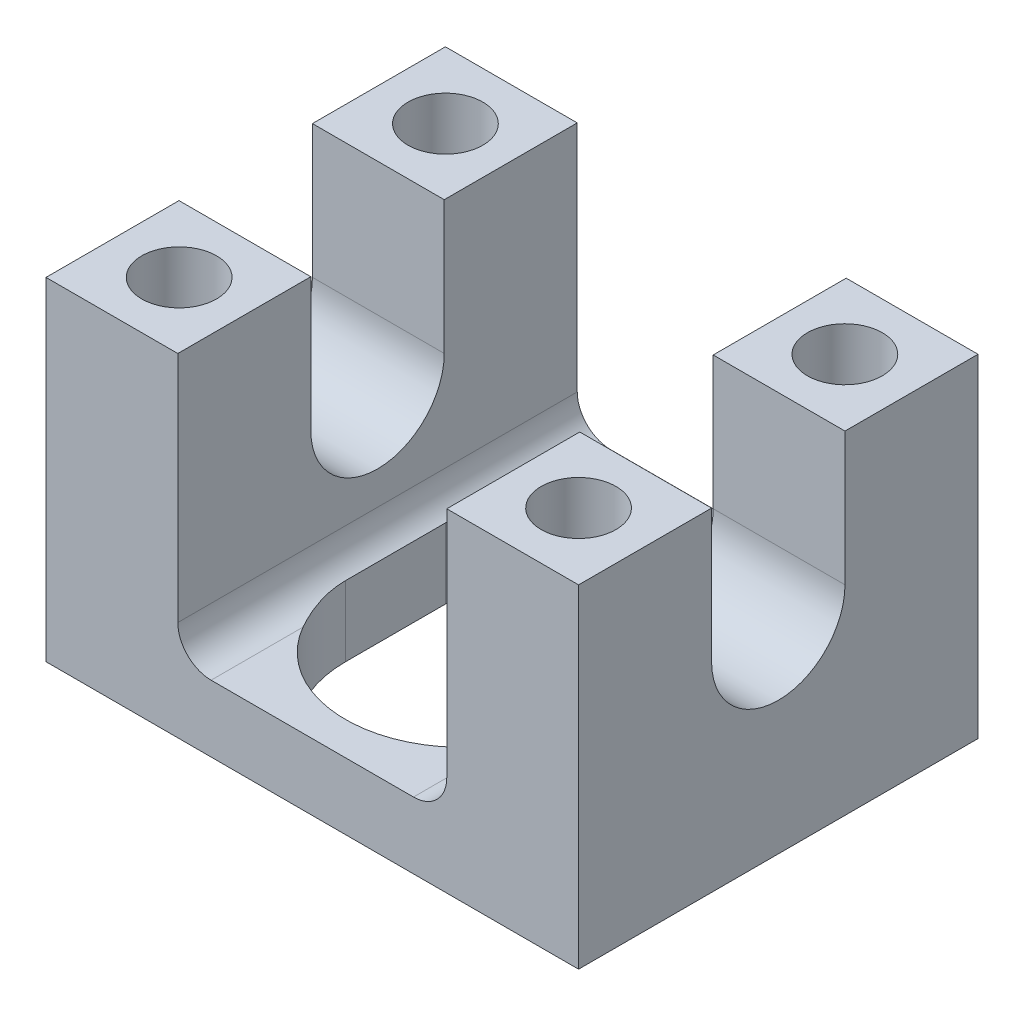
ISO-10303-21;
HEADER;
FILE_DESCRIPTION(('STEP AP214'),'2;1');
FILE_NAME('part.step','',(''),(''),'','','');
FILE_SCHEMA(('AUTOMOTIVE_DESIGN { 1 0 10303 214 1 1 1 1 }'));
ENDSEC;
DATA;
#1=APPLICATION_CONTEXT('core data for automotive mechanical design processes');
#2=APPLICATION_PROTOCOL_DEFINITION('international standard','automotive_design',2000,#1);
#3=PRODUCT_CONTEXT('',#1,'mechanical');
#4=PRODUCT('Part','Part','',(#3));
#5=PRODUCT_RELATED_PRODUCT_CATEGORY('part','',(#4));
#6=PRODUCT_DEFINITION_FORMATION('','',#4);
#7=PRODUCT_DEFINITION_CONTEXT('part definition',#1,'design');
#8=PRODUCT_DEFINITION('design','',#6,#7);
#9=PRODUCT_DEFINITION_SHAPE('','',#8);
#10=(LENGTH_UNIT() NAMED_UNIT(*) SI_UNIT(.MILLI.,.METRE.));
#11=(NAMED_UNIT(*) PLANE_ANGLE_UNIT() SI_UNIT($,.RADIAN.));
#12=(NAMED_UNIT(*) SI_UNIT($,.STERADIAN.) SOLID_ANGLE_UNIT());
#13=UNCERTAINTY_MEASURE_WITH_UNIT(LENGTH_MEASURE(1.E-05),#10,'distance_accuracy_value','');
#14=(GEOMETRIC_REPRESENTATION_CONTEXT(3) GLOBAL_UNCERTAINTY_ASSIGNED_CONTEXT((#13)) GLOBAL_UNIT_ASSIGNED_CONTEXT((#10,
#11,#12)) REPRESENTATION_CONTEXT('',''));
#15=CARTESIAN_POINT('',(0.,0.,0.));
#16=DIRECTION('',(0.,0.,1.));
#17=DIRECTION('',(1.,0.,0.));
#18=AXIS2_PLACEMENT_3D('',#15,#16,#17);
#19=CARTESIAN_POINT('',(12.827,-9.525,19.05));
#20=DIRECTION('',(0.,-1.,0.));
#21=DIRECTION('',(0.,0.,-1.));
#22=AXIS2_PLACEMENT_3D('',#19,#20,#21);
#23=PLANE('',#22);
#24=DIRECTION('',(0.,0.,-1.));
#25=VECTOR('',#24,1.);
#26=CARTESIAN_POINT('',(-9.652,-9.525,19.05));
#27=LINE('',#26,#25);
#28=CARTESIAN_POINT('',(-9.652,-9.525,-19.05));
#29=VERTEX_POINT('',#28);
#30=CARTESIAN_POINT('',(-9.652,-9.525,-10.2821548981265));
#31=VERTEX_POINT('',#30);
#32=EDGE_CURVE('E400',#29,#31,#27,.F.);
#33=ORIENTED_EDGE('',*,*,#32,.T.);
#34=CARTESIAN_POINT('',(0.,-9.525,-4.7752));
#35=DIRECTION('',(0.,-1.,0.));
#36=DIRECTION('',(0.,0.,-1.));
#37=AXIS2_PLACEMENT_3D('',#34,#35,#36);
#38=CIRCLE('',#37,11.1125);
#39=CARTESIAN_POINT('',(9.652,-9.525,-10.2821548981266));
#40=VERTEX_POINT('',#39);
#41=EDGE_CURVE('E249',#31,#40,#38,.T.);
#42=ORIENTED_EDGE('',*,*,#41,.T.);
#43=DIRECTION('',(0.,0.,-1.));
#44=VECTOR('',#43,1.);
#45=CARTESIAN_POINT('',(9.652,-9.525,-19.05));
#46=LINE('',#45,#44);
#47=CARTESIAN_POINT('',(9.652,-9.525,-19.05));
#48=VERTEX_POINT('',#47);
#49=EDGE_CURVE('E403',#40,#48,#46,.T.);
#50=ORIENTED_EDGE('',*,*,#49,.T.);
#51=DIRECTION('',(-1.,0.,0.));
#52=VECTOR('',#51,1.);
#53=CARTESIAN_POINT('',(12.827,-9.525,-19.05));
#54=LINE('',#53,#52);
#55=EDGE_CURVE('E367',#48,#29,#54,.T.);
#56=ORIENTED_EDGE('',*,*,#55,.T.);
#57=EDGE_LOOP('',(#33,#42,#50,#56));
#58=FACE_BOUND('',#57,.T.);
#59=ADVANCED_FACE('F44',(#58),#23,.F.);
#60=CARTESIAN_POINT('',(25.4,15.875,19.05));
#61=DIRECTION('',(0.,-1.,0.));
#62=DIRECTION('',(1.,0.,0.));
#63=AXIS2_PLACEMENT_3D('',#60,#61,#62);
#64=PLANE('',#63);
#65=CARTESIAN_POINT('',(19.05,15.875,12.7));
#66=DIRECTION('',(0.,1.,0.));
#67=DIRECTION('',(0.,0.,1.));
#68=AXIS2_PLACEMENT_3D('',#65,#66,#67);
#69=CIRCLE('',#68,3.5687);
#70=CARTESIAN_POINT('',(19.05,15.875,16.2687));
#71=VERTEX_POINT('',#70);
#72=EDGE_CURVE('E552',#71,#71,#69,.T.);
#73=ORIENTED_EDGE('',*,*,#72,.F.);
#74=EDGE_LOOP('',(#73));
#75=FACE_BOUND('',#74,.T.);
#76=DIRECTION('',(0.,0.,-1.));
#77=VECTOR('',#76,1.);
#78=CARTESIAN_POINT('',(25.4,15.875,19.05));
#79=LINE('',#78,#77);
#80=CARTESIAN_POINT('',(25.4,15.875,19.05));
#81=VERTEX_POINT('',#80);
#82=CARTESIAN_POINT('',(25.4,15.875,6.3627));
#83=VERTEX_POINT('',#82);
#84=EDGE_CURVE('E396',#81,#83,#79,.T.);
#85=ORIENTED_EDGE('',*,*,#84,.T.);
#86=DIRECTION('',(-1.,0.,0.));
#87=VECTOR('',#86,1.);
#88=CARTESIAN_POINT('',(25.4,15.875,6.3627));
#89=LINE('',#88,#87);
#90=CARTESIAN_POINT('',(12.827,15.875,6.3627));
#91=VERTEX_POINT('',#90);
#92=EDGE_CURVE('E305',#83,#91,#89,.T.);
#93=ORIENTED_EDGE('',*,*,#92,.T.);
#94=DIRECTION('',(0.,0.,-1.));
#95=VECTOR('',#94,1.);
#96=CARTESIAN_POINT('',(12.827,15.875,19.05));
#97=LINE('',#96,#95);
#98=CARTESIAN_POINT('',(12.827,15.875,19.05));
#99=VERTEX_POINT('',#98);
#100=EDGE_CURVE('E392',#99,#91,#97,.T.);
#101=ORIENTED_EDGE('',*,*,#100,.F.);
#102=DIRECTION('',(-1.,0.,0.));
#103=VECTOR('',#102,1.);
#104=CARTESIAN_POINT('',(25.4,15.875,19.05));
#105=LINE('',#104,#103);
#106=EDGE_CURVE('E341',#81,#99,#105,.T.);
#107=ORIENTED_EDGE('',*,*,#106,.F.);
#108=EDGE_LOOP('',(#85,#93,#101,#107));
#109=FACE_BOUND('',#108,.T.);
#110=ADVANCED_FACE('F477',(#75,#109),#64,.F.);
#111=CARTESIAN_POINT('',(-12.827,15.875,19.05));
#112=DIRECTION('',(0.,-1.,0.));
#113=DIRECTION('',(0.,0.,-1.));
#114=AXIS2_PLACEMENT_3D('',#111,#112,#113);
#115=PLANE('',#114);
#116=CARTESIAN_POINT('',(-19.05,15.875,12.7));
#117=DIRECTION('',(0.,1.,0.));
#118=DIRECTION('',(0.,0.,1.));
#119=AXIS2_PLACEMENT_3D('',#116,#117,#118);
#120=CIRCLE('',#119,3.5687);
#121=CARTESIAN_POINT('',(-19.05,15.875,16.2687));
#122=VERTEX_POINT('',#121);
#123=EDGE_CURVE('E546',#122,#122,#120,.T.);
#124=ORIENTED_EDGE('',*,*,#123,.F.);
#125=EDGE_LOOP('',(#124));
#126=FACE_BOUND('',#125,.T.);
#127=DIRECTION('',(0.,0.,-1.));
#128=VECTOR('',#127,1.);
#129=CARTESIAN_POINT('',(-12.827,15.875,19.05));
#130=LINE('',#129,#128);
#131=CARTESIAN_POINT('',(-12.827,15.875,19.05));
#132=VERTEX_POINT('',#131);
#133=CARTESIAN_POINT('',(-12.827,15.875,6.3627));
#134=VERTEX_POINT('',#133);
#135=EDGE_CURVE('E388',#132,#134,#130,.T.);
#136=ORIENTED_EDGE('',*,*,#135,.T.);
#137=CARTESIAN_POINT('',(-25.4,15.875,6.3627));
#138=VERTEX_POINT('',#137);
#139=EDGE_CURVE('E309',#134,#138,#89,.T.);
#140=ORIENTED_EDGE('',*,*,#139,.T.);
#141=DIRECTION('',(0.,0.,-1.));
#142=VECTOR('',#141,1.);
#143=CARTESIAN_POINT('',(-25.4,15.875,19.05));
#144=LINE('',#143,#142);
#145=CARTESIAN_POINT('',(-25.4,15.875,19.05));
#146=VERTEX_POINT('',#145);
#147=EDGE_CURVE('E384',#146,#138,#144,.T.);
#148=ORIENTED_EDGE('',*,*,#147,.F.);
#149=DIRECTION('',(-1.,0.,0.));
#150=VECTOR('',#149,1.);
#151=CARTESIAN_POINT('',(-12.827,15.875,19.05));
#152=LINE('',#151,#150);
#153=EDGE_CURVE('E352',#132,#146,#152,.T.);
#154=ORIENTED_EDGE('',*,*,#153,.F.);
#155=EDGE_LOOP('',(#136,#140,#148,#154));
#156=FACE_BOUND('',#155,.T.);
#157=ADVANCED_FACE('F460',(#126,#156),#115,.F.);
#158=CARTESIAN_POINT('',(25.4,15.875,19.05));
#159=DIRECTION('',(-1.,0.,0.));
#160=DIRECTION('',(0.,0.,1.));
#161=AXIS2_PLACEMENT_3D('',#158,#159,#160);
#162=PLANE('',#161);
#163=CARTESIAN_POINT('',(25.4,3.17500000000001,0.));
#164=DIRECTION('',(-1.,0.,0.));
#165=DIRECTION('',(0.,-1.,0.));
#166=AXIS2_PLACEMENT_3D('',#163,#164,#165);
#167=CIRCLE('',#166,6.3627);
#168=CARTESIAN_POINT('',(25.4,3.17500000000001,-6.3627));
#169=VERTEX_POINT('',#168);
#170=CARTESIAN_POINT('',(25.4,3.17500000000001,6.3627));
#171=VERTEX_POINT('',#170);
#172=EDGE_CURVE('E291',#169,#171,#167,.T.);
#173=ORIENTED_EDGE('',*,*,#172,.T.);
#174=DIRECTION('',(0.,1.,0.));
#175=VECTOR('',#174,1.);
#176=CARTESIAN_POINT('',(25.4,15.875,6.3627));
#177=LINE('',#176,#175);
#178=EDGE_CURVE('E295',#171,#83,#177,.T.);
#179=ORIENTED_EDGE('',*,*,#178,.T.);
#180=ORIENTED_EDGE('',*,*,#84,.F.);
#181=DIRECTION('',(0.,1.,0.));
#182=VECTOR('',#181,1.);
#183=CARTESIAN_POINT('',(25.4,15.875,19.05));
#184=LINE('',#183,#182);
#185=CARTESIAN_POINT('',(25.4,-15.875,19.05));
#186=VERTEX_POINT('',#185);
#187=EDGE_CURVE('E338',#186,#81,#184,.T.);
#188=ORIENTED_EDGE('',*,*,#187,.F.);
#189=DIRECTION('',(0.,0.,-1.));
#190=VECTOR('',#189,1.);
#191=CARTESIAN_POINT('',(25.4,-15.875,19.05));
#192=LINE('',#191,#190);
#193=CARTESIAN_POINT('',(25.4,-15.875,-19.05));
#194=VERTEX_POINT('',#193);
#195=EDGE_CURVE('E358',#186,#194,#192,.T.);
#196=ORIENTED_EDGE('',*,*,#195,.T.);
#197=DIRECTION('',(0.,1.,0.));
#198=VECTOR('',#197,1.);
#199=CARTESIAN_POINT('',(25.4,15.875,-19.05));
#200=LINE('',#199,#198);
#201=CARTESIAN_POINT('',(25.4,15.875,-19.05));
#202=VERTEX_POINT('',#201);
#203=EDGE_CURVE('E337',#194,#202,#200,.T.);
#204=ORIENTED_EDGE('',*,*,#203,.T.);
#205=CARTESIAN_POINT('',(25.4,15.875,-6.3627));
#206=VERTEX_POINT('',#205);
#207=EDGE_CURVE('E395',#206,#202,#79,.T.);
#208=ORIENTED_EDGE('',*,*,#207,.F.);
#209=DIRECTION('',(0.,-1.,0.));
#210=VECTOR('',#209,1.);
#211=CARTESIAN_POINT('',(25.4,15.875,-6.3627));
#212=LINE('',#211,#210);
#213=EDGE_CURVE('E288',#206,#169,#212,.T.);
#214=ORIENTED_EDGE('',*,*,#213,.T.);
#215=EDGE_LOOP('',(#173,#179,#180,#188,#196,#204,#208,#214));
#216=FACE_BOUND('',#215,.T.);
#217=ADVANCED_FACE('F472',(#216),#162,.F.);
#218=CARTESIAN_POINT('',(19.05,15.875,-12.7));
#219=DIRECTION('',(0.,1.,0.));
#220=DIRECTION('',(0.,0.,1.));
#221=AXIS2_PLACEMENT_3D('',#218,#219,#220);
#222=CIRCLE('',#221,3.5687);
#223=CARTESIAN_POINT('',(19.05,15.875,-9.1313));
#224=VERTEX_POINT('',#223);
#225=EDGE_CURVE('E227',#224,#224,#222,.T.);
#226=ORIENTED_EDGE('',*,*,#225,.F.);
#227=EDGE_LOOP('',(#226));
#228=FACE_BOUND('',#227,.T.);
#229=CARTESIAN_POINT('',(12.827,15.875,-6.3627));
#230=VERTEX_POINT('',#229);
#231=CARTESIAN_POINT('',(12.827,15.875,-19.05));
#232=VERTEX_POINT('',#231);
#233=EDGE_CURVE('E391',#230,#232,#97,.T.);
#234=ORIENTED_EDGE('',*,*,#233,.F.);
#235=DIRECTION('',(-1.,0.,0.));
#236=VECTOR('',#235,1.);
#237=CARTESIAN_POINT('',(25.4,15.875,-6.3627));
#238=LINE('',#237,#236);
#239=EDGE_CURVE('E318',#206,#230,#238,.T.);
#240=ORIENTED_EDGE('',*,*,#239,.F.);
#241=ORIENTED_EDGE('',*,*,#207,.T.);
#242=DIRECTION('',(-1.,0.,0.));
#243=VECTOR('',#242,1.);
#244=CARTESIAN_POINT('',(25.4,15.875,-19.05));
#245=LINE('',#244,#243);
#246=EDGE_CURVE('E361',#202,#232,#245,.T.);
#247=ORIENTED_EDGE('',*,*,#246,.T.);
#248=EDGE_LOOP('',(#234,#240,#241,#247));
#249=FACE_BOUND('',#248,.T.);
#250=ADVANCED_FACE('F493',(#228,#249),#64,.F.);
#251=CARTESIAN_POINT('',(12.827,15.875,19.05));
#252=DIRECTION('',(1.,0.,0.));
#253=DIRECTION('',(0.,0.,-1.));
#254=AXIS2_PLACEMENT_3D('',#251,#252,#253);
#255=PLANE('',#254);
#256=DIRECTION('',(0.,-1.,0.));
#257=VECTOR('',#256,1.);
#258=CARTESIAN_POINT('',(12.827,15.875,-19.05));
#259=LINE('',#258,#257);
#260=CARTESIAN_POINT('',(12.827,-6.35,-19.05));
#261=VERTEX_POINT('',#260);
#262=EDGE_CURVE('E364',#232,#261,#259,.T.);
#263=ORIENTED_EDGE('',*,*,#262,.T.);
#264=DIRECTION('',(0.,0.,-1.));
#265=VECTOR('',#264,1.);
#266=CARTESIAN_POINT('',(12.827,-6.35,19.05));
#267=LINE('',#266,#265);
#268=CARTESIAN_POINT('',(12.827,-6.35,19.05));
#269=VERTEX_POINT('',#268);
#270=EDGE_CURVE('E407',#261,#269,#267,.F.);
#271=ORIENTED_EDGE('',*,*,#270,.T.);
#272=DIRECTION('',(0.,-1.,0.));
#273=VECTOR('',#272,1.);
#274=CARTESIAN_POINT('',(12.827,15.875,19.05));
#275=LINE('',#274,#273);
#276=EDGE_CURVE('E344',#99,#269,#275,.T.);
#277=ORIENTED_EDGE('',*,*,#276,.F.);
#278=ORIENTED_EDGE('',*,*,#100,.T.);
#279=DIRECTION('',(0.,-1.,0.));
#280=VECTOR('',#279,1.);
#281=CARTESIAN_POINT('',(12.827,15.875,6.3627));
#282=LINE('',#281,#280);
#283=CARTESIAN_POINT('',(12.827,3.17500000000001,6.3627));
#284=VERTEX_POINT('',#283);
#285=EDGE_CURVE('E334',#91,#284,#282,.T.);
#286=ORIENTED_EDGE('',*,*,#285,.T.);
#287=CARTESIAN_POINT('',(12.827,3.17500000000001,0.));
#288=DIRECTION('',(1.,0.,0.));
#289=DIRECTION('',(0.,0.,-1.));
#290=AXIS2_PLACEMENT_3D('',#287,#288,#289);
#291=CIRCLE('',#290,6.3627);
#292=CARTESIAN_POINT('',(12.827,3.17500000000001,-6.3627));
#293=VERTEX_POINT('',#292);
#294=EDGE_CURVE('E328',#284,#293,#291,.T.);
#295=ORIENTED_EDGE('',*,*,#294,.T.);
#296=DIRECTION('',(0.,1.,0.));
#297=VECTOR('',#296,1.);
#298=CARTESIAN_POINT('',(12.827,15.875,-6.3627));
#299=LINE('',#298,#297);
#300=EDGE_CURVE('E322',#293,#230,#299,.T.);
#301=ORIENTED_EDGE('',*,*,#300,.T.);
#302=ORIENTED_EDGE('',*,*,#233,.T.);
#303=EDGE_LOOP('',(#263,#271,#277,#278,#286,#295,#301,#302));
#304=FACE_BOUND('',#303,.T.);
#305=ADVANCED_FACE('F479',(#304),#255,.F.);
#306=CARTESIAN_POINT('',(9.652,-9.525,19.05));
#307=VERTEX_POINT('',#306);
#308=CARTESIAN_POINT('',(9.652,-9.525,10.2821548981266));
#309=VERTEX_POINT('',#308);
#310=EDGE_CURVE('E404',#307,#309,#46,.T.);
#311=ORIENTED_EDGE('',*,*,#310,.T.);
#312=CARTESIAN_POINT('',(0.,-9.525,4.7752));
#313=DIRECTION('',(0.,-1.,0.));
#314=DIRECTION('',(0.,0.,-1.));
#315=AXIS2_PLACEMENT_3D('',#312,#313,#314);
#316=CIRCLE('',#315,11.1125);
#317=CARTESIAN_POINT('',(-9.652,-9.525,10.2821548981265));
#318=VERTEX_POINT('',#317);
#319=EDGE_CURVE('E235',#309,#318,#316,.T.);
#320=ORIENTED_EDGE('',*,*,#319,.T.);
#321=CARTESIAN_POINT('',(-9.652,-9.525,19.05));
#322=VERTEX_POINT('',#321);
#323=EDGE_CURVE('E399',#318,#322,#27,.F.);
#324=ORIENTED_EDGE('',*,*,#323,.T.);
#325=DIRECTION('',(-1.,0.,0.));
#326=VECTOR('',#325,1.);
#327=CARTESIAN_POINT('',(12.827,-9.525,19.05));
#328=LINE('',#327,#326);
#329=EDGE_CURVE('E347',#307,#322,#328,.T.);
#330=ORIENTED_EDGE('',*,*,#329,.F.);
#331=EDGE_LOOP('',(#311,#320,#324,#330));
#332=FACE_BOUND('',#331,.T.);
#333=ADVANCED_FACE('F425',(#332),#23,.F.);
#334=CARTESIAN_POINT('',(-12.827,-9.525,19.05));
#335=DIRECTION('',(-1.,0.,0.));
#336=DIRECTION('',(0.,0.,1.));
#337=AXIS2_PLACEMENT_3D('',#334,#335,#336);
#338=PLANE('',#337);
#339=DIRECTION('',(0.,1.,0.));
#340=VECTOR('',#339,1.);
#341=CARTESIAN_POINT('',(-12.827,-9.525,19.05));
#342=LINE('',#341,#340);
#343=CARTESIAN_POINT('',(-12.827,-6.35,19.05));
#344=VERTEX_POINT('',#343);
#345=EDGE_CURVE('E350',#344,#132,#342,.T.);
#346=ORIENTED_EDGE('',*,*,#345,.F.);
#347=DIRECTION('',(0.,0.,-1.));
#348=VECTOR('',#347,1.);
#349=CARTESIAN_POINT('',(-12.827,-6.35,-19.05));
#350=LINE('',#349,#348);
#351=CARTESIAN_POINT('',(-12.827,-6.35,-19.05));
#352=VERTEX_POINT('',#351);
#353=EDGE_CURVE('E409',#344,#352,#350,.T.);
#354=ORIENTED_EDGE('',*,*,#353,.T.);
#355=DIRECTION('',(0.,1.,0.));
#356=VECTOR('',#355,1.);
#357=CARTESIAN_POINT('',(-12.827,-9.525,-19.05));
#358=LINE('',#357,#356);
#359=CARTESIAN_POINT('',(-12.827,15.875,-19.05));
#360=VERTEX_POINT('',#359);
#361=EDGE_CURVE('E370',#352,#360,#358,.T.);
#362=ORIENTED_EDGE('',*,*,#361,.T.);
#363=CARTESIAN_POINT('',(-12.827,15.875,-6.3627));
#364=VERTEX_POINT('',#363);
#365=EDGE_CURVE('E387',#364,#360,#130,.T.);
#366=ORIENTED_EDGE('',*,*,#365,.F.);
#367=DIRECTION('',(0.,-1.,0.));
#368=VECTOR('',#367,1.);
#369=CARTESIAN_POINT('',(-12.827,-9.52500000000001,-6.3627));
#370=LINE('',#369,#368);
#371=CARTESIAN_POINT('',(-12.827,3.175,-6.3627));
#372=VERTEX_POINT('',#371);
#373=EDGE_CURVE('E308',#364,#372,#370,.T.);
#374=ORIENTED_EDGE('',*,*,#373,.T.);
#375=CARTESIAN_POINT('',(-12.827,3.175,0.));
#376=DIRECTION('',(-1.,0.,0.));
#377=DIRECTION('',(0.,0.,1.));
#378=AXIS2_PLACEMENT_3D('',#375,#376,#377);
#379=CIRCLE('',#378,6.3627);
#380=CARTESIAN_POINT('',(-12.827,3.175,6.3627));
#381=VERTEX_POINT('',#380);
#382=EDGE_CURVE('E325',#372,#381,#379,.T.);
#383=ORIENTED_EDGE('',*,*,#382,.T.);
#384=DIRECTION('',(0.,1.,0.));
#385=VECTOR('',#384,1.);
#386=CARTESIAN_POINT('',(-12.827,-9.525,6.3627));
#387=LINE('',#386,#385);
#388=EDGE_CURVE('E331',#381,#134,#387,.T.);
#389=ORIENTED_EDGE('',*,*,#388,.T.);
#390=ORIENTED_EDGE('',*,*,#135,.F.);
#391=EDGE_LOOP('',(#346,#354,#362,#366,#374,#383,#389,#390));
#392=FACE_BOUND('',#391,.T.);
#393=ADVANCED_FACE('F431',(#392),#338,.F.);
#394=CARTESIAN_POINT('',(-19.05,15.875,-12.7));
#395=DIRECTION('',(0.,1.,0.));
#396=DIRECTION('',(0.,0.,1.));
#397=AXIS2_PLACEMENT_3D('',#394,#395,#396);
#398=CIRCLE('',#397,3.5687);
#399=CARTESIAN_POINT('',(-19.05,15.875,-9.1313));
#400=VERTEX_POINT('',#399);
#401=EDGE_CURVE('E541',#400,#400,#398,.T.);
#402=ORIENTED_EDGE('',*,*,#401,.F.);
#403=EDGE_LOOP('',(#402));
#404=FACE_BOUND('',#403,.T.);
#405=CARTESIAN_POINT('',(-25.4,15.875,-6.3627));
#406=VERTEX_POINT('',#405);
#407=CARTESIAN_POINT('',(-25.4,15.875,-19.05));
#408=VERTEX_POINT('',#407);
#409=EDGE_CURVE('E383',#406,#408,#144,.T.);
#410=ORIENTED_EDGE('',*,*,#409,.F.);
#411=EDGE_CURVE('E298',#364,#406,#238,.T.);
#412=ORIENTED_EDGE('',*,*,#411,.F.);
#413=ORIENTED_EDGE('',*,*,#365,.T.);
#414=DIRECTION('',(-1.,0.,0.));
#415=VECTOR('',#414,1.);
#416=CARTESIAN_POINT('',(-12.827,15.875,-19.05));
#417=LINE('',#416,#415);
#418=EDGE_CURVE('E372',#360,#408,#417,.T.);
#419=ORIENTED_EDGE('',*,*,#418,.T.);
#420=EDGE_LOOP('',(#410,#412,#413,#419));
#421=FACE_BOUND('',#420,.T.);
#422=ADVANCED_FACE('F444',(#404,#421),#115,.F.);
#423=CARTESIAN_POINT('',(-25.4,15.875,19.05));
#424=DIRECTION('',(1.,0.,0.));
#425=DIRECTION('',(0.,0.,-1.));
#426=AXIS2_PLACEMENT_3D('',#423,#424,#425);
#427=PLANE('',#426);
#428=ORIENTED_EDGE('',*,*,#147,.T.);
#429=DIRECTION('',(0.,1.,0.));
#430=VECTOR('',#429,1.);
#431=CARTESIAN_POINT('',(-25.4,15.875,6.3627));
#432=LINE('',#431,#430);
#433=CARTESIAN_POINT('',(-25.4,3.175,6.3627));
#434=VERTEX_POINT('',#433);
#435=EDGE_CURVE('E292',#434,#138,#432,.T.);
#436=ORIENTED_EDGE('',*,*,#435,.F.);
#437=CARTESIAN_POINT('',(-25.4,3.175,0.));
#438=DIRECTION('',(-1.,0.,0.));
#439=DIRECTION('',(0.,-1.,0.));
#440=AXIS2_PLACEMENT_3D('',#437,#438,#439);
#441=CIRCLE('',#440,6.3627);
#442=CARTESIAN_POINT('',(-25.4,3.175,-6.3627));
#443=VERTEX_POINT('',#442);
#444=EDGE_CURVE('E301',#443,#434,#441,.T.);
#445=ORIENTED_EDGE('',*,*,#444,.F.);
#446=DIRECTION('',(0.,-1.,0.));
#447=VECTOR('',#446,1.);
#448=CARTESIAN_POINT('',(-25.4,15.875,-6.3627));
#449=LINE('',#448,#447);
#450=EDGE_CURVE('E287',#406,#443,#449,.T.);
#451=ORIENTED_EDGE('',*,*,#450,.F.);
#452=ORIENTED_EDGE('',*,*,#409,.T.);
#453=DIRECTION('',(0.,-1.,0.));
#454=VECTOR('',#453,1.);
#455=CARTESIAN_POINT('',(-25.4,15.875,-19.05));
#456=LINE('',#455,#454);
#457=CARTESIAN_POINT('',(-25.4,-15.875,-19.05));
#458=VERTEX_POINT('',#457);
#459=EDGE_CURVE('E375',#408,#458,#456,.T.);
#460=ORIENTED_EDGE('',*,*,#459,.T.);
#461=DIRECTION('',(0.,0.,-1.));
#462=VECTOR('',#461,1.);
#463=CARTESIAN_POINT('',(-25.4,-15.875,19.05));
#464=LINE('',#463,#462);
#465=CARTESIAN_POINT('',(-25.4,-15.875,19.05));
#466=VERTEX_POINT('',#465);
#467=EDGE_CURVE('E380',#466,#458,#464,.T.);
#468=ORIENTED_EDGE('',*,*,#467,.F.);
#469=DIRECTION('',(0.,-1.,0.));
#470=VECTOR('',#469,1.);
#471=CARTESIAN_POINT('',(-25.4,15.875,19.05));
#472=LINE('',#471,#470);
#473=EDGE_CURVE('E354',#146,#466,#472,.T.);
#474=ORIENTED_EDGE('',*,*,#473,.F.);
#475=EDGE_LOOP('',(#428,#436,#445,#451,#452,#460,#468,#474));
#476=FACE_BOUND('',#475,.T.);
#477=ADVANCED_FACE('F468',(#476),#427,.F.);
#478=CARTESIAN_POINT('',(25.4,-15.875,19.05));
#479=DIRECTION('',(0.,1.,0.));
#480=DIRECTION('',(-1.,0.,0.));
#481=AXIS2_PLACEMENT_3D('',#478,#479,#480);
#482=PLANE('',#481);
#483=CARTESIAN_POINT('',(-19.05,-15.875,-12.7));
#484=DIRECTION('',(0.,1.,0.));
#485=DIRECTION('',(0.,0.,1.));
#486=AXIS2_PLACEMENT_3D('',#483,#484,#485);
#487=CIRCLE('',#486,3.5687);
#488=CARTESIAN_POINT('',(-19.05,-15.875,-9.1313));
#489=VERTEX_POINT('',#488);
#490=EDGE_CURVE('E543',#489,#489,#487,.T.);
#491=ORIENTED_EDGE('',*,*,#490,.T.);
#492=EDGE_LOOP('',(#491));
#493=FACE_BOUND('',#492,.T.);
#494=CARTESIAN_POINT('',(-19.05,-15.875,12.7));
#495=DIRECTION('',(0.,1.,0.));
#496=DIRECTION('',(0.,0.,1.));
#497=AXIS2_PLACEMENT_3D('',#494,#495,#496);
#498=CIRCLE('',#497,3.5687);
#499=CARTESIAN_POINT('',(-19.05,-15.875,16.2687));
#500=VERTEX_POINT('',#499);
#501=EDGE_CURVE('E549',#500,#500,#498,.T.);
#502=ORIENTED_EDGE('',*,*,#501,.T.);
#503=EDGE_LOOP('',(#502));
#504=FACE_BOUND('',#503,.T.);
#505=CARTESIAN_POINT('',(19.05,-15.875,12.7));
#506=DIRECTION('',(0.,1.,0.));
#507=DIRECTION('',(0.,0.,1.));
#508=AXIS2_PLACEMENT_3D('',#505,#506,#507);
#509=CIRCLE('',#508,3.5687);
#510=CARTESIAN_POINT('',(19.05,-15.875,16.2687));
#511=VERTEX_POINT('',#510);
#512=EDGE_CURVE('E555',#511,#511,#509,.T.);
#513=ORIENTED_EDGE('',*,*,#512,.T.);
#514=EDGE_LOOP('',(#513));
#515=FACE_BOUND('',#514,.T.);
#516=CARTESIAN_POINT('',(19.05,-15.875,-12.7));
#517=DIRECTION('',(0.,1.,0.));
#518=DIRECTION('',(0.,0.,1.));
#519=AXIS2_PLACEMENT_3D('',#516,#517,#518);
#520=CIRCLE('',#519,3.5687);
#521=CARTESIAN_POINT('',(19.05,-15.875,-9.1313));
#522=VERTEX_POINT('',#521);
#523=EDGE_CURVE('E224',#522,#522,#520,.T.);
#524=ORIENTED_EDGE('',*,*,#523,.T.);
#525=EDGE_LOOP('',(#524));
#526=FACE_BOUND('',#525,.T.);
#527=DIRECTION('',(0.,0.,-1.));
#528=VECTOR('',#527,1.);
#529=CARTESIAN_POINT('',(11.1125,-15.875,4.7752));
#530=LINE('',#529,#528);
#531=CARTESIAN_POINT('',(11.1125,-15.875,4.7752));
#532=VERTEX_POINT('',#531);
#533=CARTESIAN_POINT('',(11.1125,-15.875,-4.7752));
#534=VERTEX_POINT('',#533);
#535=EDGE_CURVE('E214',#532,#534,#530,.T.);
#536=ORIENTED_EDGE('',*,*,#535,.T.);
#537=CARTESIAN_POINT('',(0.,-15.875,-4.7752));
#538=DIRECTION('',(0.,1.,0.));
#539=DIRECTION('',(0.,0.,1.));
#540=AXIS2_PLACEMENT_3D('',#537,#538,#539);
#541=CIRCLE('',#540,11.1125);
#542=CARTESIAN_POINT('',(-11.1125,-15.875,-4.7752));
#543=VERTEX_POINT('',#542);
#544=EDGE_CURVE('E209',#534,#543,#541,.T.);
#545=ORIENTED_EDGE('',*,*,#544,.T.);
#546=DIRECTION('',(0.,0.,1.));
#547=VECTOR('',#546,1.);
#548=CARTESIAN_POINT('',(-11.1125,-15.875,4.7752));
#549=LINE('',#548,#547);
#550=CARTESIAN_POINT('',(-11.1125,-15.875,4.7752));
#551=VERTEX_POINT('',#550);
#552=EDGE_CURVE('E217',#543,#551,#549,.T.);
#553=ORIENTED_EDGE('',*,*,#552,.T.);
#554=CARTESIAN_POINT('',(0.,-15.875,4.7752));
#555=DIRECTION('',(0.,1.,0.));
#556=DIRECTION('',(0.,0.,1.));
#557=AXIS2_PLACEMENT_3D('',#554,#555,#556);
#558=CIRCLE('',#557,11.1125);
#559=EDGE_CURVE('E60',#551,#532,#558,.T.);
#560=ORIENTED_EDGE('',*,*,#559,.T.);
#561=EDGE_LOOP('',(#536,#545,#553,#560));
#562=FACE_BOUND('',#561,.T.);
#563=DIRECTION('',(1.,0.,0.));
#564=VECTOR('',#563,1.);
#565=CARTESIAN_POINT('',(25.4,-15.875,-19.05));
#566=LINE('',#565,#564);
#567=EDGE_CURVE('E342',#458,#194,#566,.T.);
#568=ORIENTED_EDGE('',*,*,#567,.T.);
#569=ORIENTED_EDGE('',*,*,#195,.F.);
#570=DIRECTION('',(1.,0.,0.));
#571=VECTOR('',#570,1.);
#572=CARTESIAN_POINT('',(25.4,-15.875,19.05));
#573=LINE('',#572,#571);
#574=EDGE_CURVE('E356',#466,#186,#573,.T.);
#575=ORIENTED_EDGE('',*,*,#574,.F.);
#576=ORIENTED_EDGE('',*,*,#467,.T.);
#577=EDGE_LOOP('',(#568,#569,#575,#576));
#578=FACE_BOUND('',#577,.T.);
#579=ADVANCED_FACE('F221',(#493,#504,#515,#526,#562,#578),#482,.F.);
#580=CARTESIAN_POINT('',(25.4,15.875,19.05));
#581=DIRECTION('',(0.,0.,-1.));
#582=DIRECTION('',(-1.,0.,0.));
#583=AXIS2_PLACEMENT_3D('',#580,#581,#582);
#584=PLANE('',#583);
#585=ORIENTED_EDGE('',*,*,#187,.T.);
#586=ORIENTED_EDGE('',*,*,#106,.T.);
#587=ORIENTED_EDGE('',*,*,#276,.T.);
#588=CARTESIAN_POINT('',(9.652,-6.35,19.05));
#589=DIRECTION('',(0.,0.,-1.));
#590=DIRECTION('',(-1.,0.,0.));
#591=AXIS2_PLACEMENT_3D('',#588,#589,#590);
#592=CIRCLE('',#591,3.175);
#593=EDGE_CURVE('E414',#269,#307,#592,.T.);
#594=ORIENTED_EDGE('',*,*,#593,.T.);
#595=ORIENTED_EDGE('',*,*,#329,.T.);
#596=CARTESIAN_POINT('',(-9.652,-6.35,19.05));
#597=DIRECTION('',(0.,0.,-1.));
#598=DIRECTION('',(-1.,0.,0.));
#599=AXIS2_PLACEMENT_3D('',#596,#597,#598);
#600=CIRCLE('',#599,3.175);
#601=EDGE_CURVE('E417',#322,#344,#600,.T.);
#602=ORIENTED_EDGE('',*,*,#601,.T.);
#603=ORIENTED_EDGE('',*,*,#345,.T.);
#604=ORIENTED_EDGE('',*,*,#153,.T.);
#605=ORIENTED_EDGE('',*,*,#473,.T.);
#606=ORIENTED_EDGE('',*,*,#574,.T.);
#607=EDGE_LOOP('',(#585,#586,#587,#594,#595,#602,#603,#604,#605,#606));
#608=FACE_BOUND('',#607,.T.);
#609=ADVANCED_FACE('F463',(#608),#584,.F.);
#610=CARTESIAN_POINT('',(25.4,15.875,-19.05));
#611=DIRECTION('',(0.,0.,-1.));
#612=DIRECTION('',(-1.,0.,0.));
#613=AXIS2_PLACEMENT_3D('',#610,#611,#612);
#614=PLANE('',#613);
#615=ORIENTED_EDGE('',*,*,#203,.F.);
#616=ORIENTED_EDGE('',*,*,#567,.F.);
#617=ORIENTED_EDGE('',*,*,#459,.F.);
#618=ORIENTED_EDGE('',*,*,#418,.F.);
#619=ORIENTED_EDGE('',*,*,#361,.F.);
#620=CARTESIAN_POINT('',(-9.652,-6.35,-19.05));
#621=DIRECTION('',(0.,0.,-1.));
#622=DIRECTION('',(-1.,0.,0.));
#623=AXIS2_PLACEMENT_3D('',#620,#621,#622);
#624=CIRCLE('',#623,3.175);
#625=EDGE_CURVE('E416',#352,#29,#624,.F.);
#626=ORIENTED_EDGE('',*,*,#625,.T.);
#627=ORIENTED_EDGE('',*,*,#55,.F.);
#628=CARTESIAN_POINT('',(9.652,-6.35,-19.05));
#629=DIRECTION('',(0.,0.,-1.));
#630=DIRECTION('',(-1.,0.,0.));
#631=AXIS2_PLACEMENT_3D('',#628,#629,#630);
#632=CIRCLE('',#631,3.175);
#633=EDGE_CURVE('E412',#48,#261,#632,.F.);
#634=ORIENTED_EDGE('',*,*,#633,.T.);
#635=ORIENTED_EDGE('',*,*,#262,.F.);
#636=ORIENTED_EDGE('',*,*,#246,.F.);
#637=EDGE_LOOP('',(#615,#616,#617,#618,#619,#626,#627,#634,#635,#636));
#638=FACE_BOUND('',#637,.T.);
#639=ADVANCED_FACE('F438',(#638),#614,.T.);
#640=CARTESIAN_POINT('',(25.4,15.875,-6.3627));
#641=DIRECTION('',(0.,0.,-1.));
#642=DIRECTION('',(0.,1.,0.));
#643=AXIS2_PLACEMENT_3D('',#640,#641,#642);
#644=PLANE('',#643);
#645=ORIENTED_EDGE('',*,*,#411,.T.);
#646=ORIENTED_EDGE('',*,*,#450,.T.);
#647=DIRECTION('',(-1.,0.,0.));
#648=VECTOR('',#647,1.);
#649=CARTESIAN_POINT('',(25.4,3.17500000000001,-6.3627));
#650=LINE('',#649,#648);
#651=EDGE_CURVE('E317',#372,#443,#650,.T.);
#652=ORIENTED_EDGE('',*,*,#651,.F.);
#653=ORIENTED_EDGE('',*,*,#373,.F.);
#654=EDGE_LOOP('',(#645,#646,#652,#653));
#655=FACE_BOUND('',#654,.T.);
#656=ADVANCED_FACE('F448',(#655),#644,.F.);
#657=CARTESIAN_POINT('',(25.4,3.17500000000001,0.));
#658=DIRECTION('',(-1.,0.,0.));
#659=DIRECTION('',(0.,-1.,0.));
#660=AXIS2_PLACEMENT_3D('',#657,#658,#659);
#661=CYLINDRICAL_SURFACE('',#660,6.3627);
#662=ORIENTED_EDGE('',*,*,#651,.T.);
#663=ORIENTED_EDGE('',*,*,#444,.T.);
#664=DIRECTION('',(-1.,0.,0.));
#665=VECTOR('',#664,1.);
#666=CARTESIAN_POINT('',(25.4,3.17500000000001,6.3627));
#667=LINE('',#666,#665);
#668=EDGE_CURVE('E313',#381,#434,#667,.T.);
#669=ORIENTED_EDGE('',*,*,#668,.F.);
#670=ORIENTED_EDGE('',*,*,#382,.F.);
#671=EDGE_LOOP('',(#662,#663,#669,#670));
#672=FACE_BOUND('',#671,.T.);
#673=ADVANCED_FACE('F452',(#672),#661,.F.);
#674=CARTESIAN_POINT('',(25.4,15.875,6.3627));
#675=DIRECTION('',(0.,0.,1.));
#676=DIRECTION('',(0.,-1.,0.));
#677=AXIS2_PLACEMENT_3D('',#674,#675,#676);
#678=PLANE('',#677);
#679=ORIENTED_EDGE('',*,*,#668,.T.);
#680=ORIENTED_EDGE('',*,*,#435,.T.);
#681=ORIENTED_EDGE('',*,*,#139,.F.);
#682=ORIENTED_EDGE('',*,*,#388,.F.);
#683=EDGE_LOOP('',(#679,#680,#681,#682));
#684=FACE_BOUND('',#683,.T.);
#685=ADVANCED_FACE('F456',(#684),#678,.F.);
#686=ORIENTED_EDGE('',*,*,#92,.F.);
#687=ORIENTED_EDGE('',*,*,#178,.F.);
#688=EDGE_CURVE('E310',#171,#284,#667,.T.);
#689=ORIENTED_EDGE('',*,*,#688,.T.);
#690=ORIENTED_EDGE('',*,*,#285,.F.);
#691=EDGE_LOOP('',(#686,#687,#689,#690));
#692=FACE_BOUND('',#691,.T.);
#693=ADVANCED_FACE('F278',(#692),#678,.F.);
#694=ORIENTED_EDGE('',*,*,#688,.F.);
#695=ORIENTED_EDGE('',*,*,#172,.F.);
#696=EDGE_CURVE('E314',#169,#293,#650,.T.);
#697=ORIENTED_EDGE('',*,*,#696,.T.);
#698=ORIENTED_EDGE('',*,*,#294,.F.);
#699=EDGE_LOOP('',(#694,#695,#697,#698));
#700=FACE_BOUND('',#699,.T.);
#701=ADVANCED_FACE('F497',(#700),#661,.F.);
#702=ORIENTED_EDGE('',*,*,#696,.F.);
#703=ORIENTED_EDGE('',*,*,#213,.F.);
#704=ORIENTED_EDGE('',*,*,#239,.T.);
#705=ORIENTED_EDGE('',*,*,#300,.F.);
#706=EDGE_LOOP('',(#702,#703,#704,#705));
#707=FACE_BOUND('',#706,.T.);
#708=ADVANCED_FACE('F495',(#707),#644,.F.);
#709=CARTESIAN_POINT('',(9.652,-6.35,19.05));
#710=DIRECTION('',(0.,0.,1.));
#711=DIRECTION('',(1.,0.,0.));
#712=AXIS2_PLACEMENT_3D('',#709,#710,#711);
#713=CYLINDRICAL_SURFACE('',#712,3.175);
#714=ORIENTED_EDGE('',*,*,#49,.F.);
#715=CARTESIAN_POINT('',(9.652,-9.525,-10.2821548981265));
#716=CARTESIAN_POINT('',(9.71937641338091,-9.52498973664757,-10.1640699602194));
#717=CARTESIAN_POINT('',(9.78456982568389,-9.52285572460998,-10.0447663409519));
#718=CARTESIAN_POINT('',(9.91047757225465,-9.51509204450976,-9.80397007826921));
#719=CARTESIAN_POINT('',(9.97119318515734,-9.50946337870268,-9.68247807217326));
#720=CARTESIAN_POINT('',(10.0880195306511,-9.49546753098081,-9.4375933031238));
#721=CARTESIAN_POINT('',(10.1441342714108,-9.48710276508618,-9.31420230827938));
#722=CARTESIAN_POINT('',(10.2517620702137,-9.46831587631769,-9.06558257528209));
#723=CARTESIAN_POINT('',(10.3032747950355,-9.45789360463958,-8.94035370481594));
#724=CARTESIAN_POINT('',(10.4489671304433,-9.42494244196303,-8.56693098151392));
#725=CARTESIAN_POINT('',(10.5365360489343,-9.40040997307123,-8.31630387815779));
#726=CARTESIAN_POINT('',(10.6935041064946,-9.35044693541297,-7.80950637542733));
#727=CARTESIAN_POINT('',(10.7629013386985,-9.32501627271108,-7.55333539735173));
#728=CARTESIAN_POINT('',(10.8706365004457,-9.28226234931899,-7.09056616010121));
#729=CARTESIAN_POINT('',(10.9124354223922,-9.26435665666559,-6.88482379787021));
#730=CARTESIAN_POINT('',(10.984340837578,-9.23219501336397,-6.47107412288138));
#731=CARTESIAN_POINT('',(11.0144506580798,-9.21793802451911,-6.26306747200196));
#732=CARTESIAN_POINT('',(11.0632054229863,-9.19427103565294,-5.8422760248383));
#733=CARTESIAN_POINT('',(11.0816736044839,-9.18493610179672,-5.62946612849713));
#734=CARTESIAN_POINT('',(11.1001603308394,-9.17550845681818,-5.30954548110231));
#735=CARTESIAN_POINT('',(11.1047866529884,-9.17312833454803,-5.20274775563909));
#736=CARTESIAN_POINT('',(11.1109566821603,-9.16994270457822,-4.9890359569704));
#737=CARTESIAN_POINT('',(11.1125002739257,-9.1691372557526,-4.88212187956426));
#738=CARTESIAN_POINT('',(11.1125,-9.16914255581374,-4.7752));
#739=B_SPLINE_CURVE_WITH_KNOTS('',3,(#715,#716,#717,#718,#719,#720,#721,#722,#723,#724,#725,
#726,#727,#728,#729,#730,#731,#732,#733,#734,#735,#736,#737,#738),.UNSPECIFIED.,.F.,.F.,(4,2,2,
2,2,2,2,2,2,2,2,4),(0.,0.407790426459318,0.815463953916071,1.22277846655166,1.63012244804752,
2.42921651991916,3.22839441201453,3.8601725806867,4.49177078379132,5.13274155632342,
5.45346574390642,5.7742019225287),.UNSPECIFIED.);
#740=CARTESIAN_POINT('',(11.1125,-9.16914255581374,-4.7752));
#741=VERTEX_POINT('',#740);
#742=EDGE_CURVE('E281',#40,#741,#739,.T.);
#743=ORIENTED_EDGE('',*,*,#742,.T.);
#744=DIRECTION('',(0.,0.,1.));
#745=VECTOR('',#744,1.);
#746=CARTESIAN_POINT('',(11.1125,-9.16914255581374,19.05));
#747=LINE('',#746,#745);
#748=CARTESIAN_POINT('',(11.1125,-9.16914255581374,4.7752));
#749=VERTEX_POINT('',#748);
#750=EDGE_CURVE('E13',#741,#749,#747,.T.);
#751=ORIENTED_EDGE('',*,*,#750,.T.);
#752=CARTESIAN_POINT('',(11.1125,-9.16914255581374,4.7752));
#753=CARTESIAN_POINT('',(11.1125022226999,-9.16912406203025,4.9110094456575));
#754=CARTESIAN_POINT('',(11.1100104055021,-9.17043191783224,5.04681541831436));
#755=CARTESIAN_POINT('',(11.1000560571338,-9.17556469270153,5.31818431658272));
#756=CARTESIAN_POINT('',(11.0925940218713,-9.17938936065119,5.45374726508925));
#757=CARTESIAN_POINT('',(11.0727249796627,-9.18941594402047,5.72430704985433));
#758=CARTESIAN_POINT('',(11.0603221488601,-9.19561585163058,5.85930426715961));
#759=CARTESIAN_POINT('',(11.0306038283742,-9.21013069020115,6.12863844397242));
#760=CARTESIAN_POINT('',(11.0132882025942,-9.21844567975403,6.26297538508374));
#761=CARTESIAN_POINT('',(10.9547543283602,-9.24574071788906,6.65976813707888));
#762=CARTESIAN_POINT('',(10.9065736391064,-9.26728139480525,6.92105278474444));
#763=CARTESIAN_POINT('',(10.7917206311963,-9.31403265409581,7.43919656531068));
#764=CARTESIAN_POINT('',(10.7250453511773,-9.33924382388385,7.69605498247964));
#765=CARTESIAN_POINT('',(10.5893368452695,-9.3841394361083,8.15123392574967));
#766=CARTESIAN_POINT('',(10.5237082525009,-9.4038778183161,8.35057004077754));
#767=CARTESIAN_POINT('',(10.3811977119184,-9.44100624026513,8.74539366372918));
#768=CARTESIAN_POINT('',(10.3043166039225,-9.45839645507295,8.94088145763354));
#769=CARTESIAN_POINT('',(10.1382097925218,-9.48870361321168,9.33039858938618));
#770=CARTESIAN_POINT('',(10.0488175172295,-9.50155019002097,9.52436300893971));
#771=CARTESIAN_POINT('',(9.90630922563586,-9.51515863950094,9.81148126949008));
#772=CARTESIAN_POINT('',(9.85737724256862,-9.51875158886873,9.90659471962089));
#773=CARTESIAN_POINT('',(9.75674823922607,-9.52367083344342,10.0954418310257));
#774=CARTESIAN_POINT('',(9.7050504011044,-9.52499645435215,10.1891750736156));
#775=CARTESIAN_POINT('',(9.652,-9.525,10.2821548981265));
#776=B_SPLINE_CURVE_WITH_KNOTS('',3,(#752,#753,#754,#755,#756,#757,#758,#759,#760,#761,#762,
#763,#764,#765,#766,#767,#768,#769,#770,#771,#772,#773,#774,#775),.UNSPECIFIED.,.F.,.F.,(4,2,2,
2,2,2,2,2,2,2,2,4),(0.,0.407393323083306,0.814746004220142,1.22175510386721,1.62877547979022,
2.42766209671122,3.22667670565383,3.85871366287729,4.49070347281745,5.13209144034988,
5.45309850327708,5.77420101636182),.UNSPECIFIED.);
#777=EDGE_CURVE('E242',#749,#309,#776,.T.);
#778=ORIENTED_EDGE('',*,*,#777,.T.);
#779=ORIENTED_EDGE('',*,*,#310,.F.);
#780=ORIENTED_EDGE('',*,*,#593,.F.);
#781=ORIENTED_EDGE('',*,*,#270,.F.);
#782=ORIENTED_EDGE('',*,*,#633,.F.);
#783=EDGE_LOOP('',(#714,#743,#751,#778,#779,#780,#781,#782));
#784=FACE_BOUND('',#783,.T.);
#785=ADVANCED_FACE('F251',(#784),#713,.F.);
#786=CARTESIAN_POINT('',(-9.652,-6.35,19.05));
#787=DIRECTION('',(0.,0.,1.));
#788=DIRECTION('',(1.,0.,0.));
#789=AXIS2_PLACEMENT_3D('',#786,#787,#788);
#790=CYLINDRICAL_SURFACE('',#789,3.175);
#791=DIRECTION('',(0.,0.,1.));
#792=VECTOR('',#791,1.);
#793=CARTESIAN_POINT('',(-11.1125,-9.16914255581374,19.05));
#794=LINE('',#793,#792);
#795=CARTESIAN_POINT('',(-11.1125,-9.16914255581374,4.7752));
#796=VERTEX_POINT('',#795);
#797=CARTESIAN_POINT('',(-11.1125,-9.16914255581374,-4.7752));
#798=VERTEX_POINT('',#797);
#799=EDGE_CURVE('E270',#796,#798,#794,.F.);
#800=ORIENTED_EDGE('',*,*,#799,.T.);
#801=CARTESIAN_POINT('',(-11.1125,-9.16914255581374,-4.7752));
#802=CARTESIAN_POINT('',(-11.1125022226999,-9.16912406203025,-4.9110094456575));
#803=CARTESIAN_POINT('',(-11.1100104055021,-9.17043191783224,-5.04681541831436));
#804=CARTESIAN_POINT('',(-11.1000560571338,-9.17556469270153,-5.31818431658272));
#805=CARTESIAN_POINT('',(-11.0925940218713,-9.17938936065119,-5.45374726508925));
#806=CARTESIAN_POINT('',(-11.0727249796627,-9.18941594402047,-5.72430704985433));
#807=CARTESIAN_POINT('',(-11.0603221488601,-9.19561585163058,-5.85930426715961));
#808=CARTESIAN_POINT('',(-11.0306038283742,-9.21013069020115,-6.12863844397242));
#809=CARTESIAN_POINT('',(-11.0132882025942,-9.21844567975403,-6.26297538508374));
#810=CARTESIAN_POINT('',(-10.9547543283601,-9.24574071788906,-6.65976813707888));
#811=CARTESIAN_POINT('',(-10.9065736391064,-9.26728139480525,-6.92105278474444));
#812=CARTESIAN_POINT('',(-10.7917206311963,-9.31403265409581,-7.43919656531068));
#813=CARTESIAN_POINT('',(-10.7250453511773,-9.33924382388385,-7.69605498247964));
#814=CARTESIAN_POINT('',(-10.5893368452695,-9.3841394361083,-8.15123392574967));
#815=CARTESIAN_POINT('',(-10.5237082525009,-9.4038778183161,-8.35057004077754));
#816=CARTESIAN_POINT('',(-10.3811977119184,-9.44100624026513,-8.74539366372918));
#817=CARTESIAN_POINT('',(-10.3043166039225,-9.45839645507295,-8.94088145763354));
#818=CARTESIAN_POINT('',(-10.1382097925218,-9.48870361321168,-9.33039858938618));
#819=CARTESIAN_POINT('',(-10.0488175172295,-9.50155019002097,-9.52436300893971));
#820=CARTESIAN_POINT('',(-9.90630922563586,-9.51515863950094,-9.81148126949008));
#821=CARTESIAN_POINT('',(-9.85737724256862,-9.51875158886873,-9.90659471962089));
#822=CARTESIAN_POINT('',(-9.75674823922607,-9.52367083344342,-10.0954418310257));
#823=CARTESIAN_POINT('',(-9.7050504011044,-9.52499645435215,-10.1891750736156));
#824=CARTESIAN_POINT('',(-9.652,-9.525,-10.2821548981265));
#825=B_SPLINE_CURVE_WITH_KNOTS('',3,(#801,#802,#803,#804,#805,#806,#807,#808,#809,#810,#811,
#812,#813,#814,#815,#816,#817,#818,#819,#820,#821,#822,#823,#824),.UNSPECIFIED.,.F.,.F.,(4,2,2,
2,2,2,2,2,2,2,2,4),(0.,0.407393323083306,0.814746004220142,1.22175510386721,1.62877547979022,
2.42766209671122,3.22667670565383,3.85871366287729,4.49070347281745,5.13209144034988,
5.45309850327708,5.77420101636182),.UNSPECIFIED.);
#826=EDGE_CURVE('E53',#798,#31,#825,.T.);
#827=ORIENTED_EDGE('',*,*,#826,.T.);
#828=ORIENTED_EDGE('',*,*,#32,.F.);
#829=ORIENTED_EDGE('',*,*,#625,.F.);
#830=ORIENTED_EDGE('',*,*,#353,.F.);
#831=ORIENTED_EDGE('',*,*,#601,.F.);
#832=ORIENTED_EDGE('',*,*,#323,.F.);
#833=CARTESIAN_POINT('',(-9.652,-9.525,10.2821548981265));
#834=CARTESIAN_POINT('',(-9.71937641338091,-9.52498973664757,10.1640699602194));
#835=CARTESIAN_POINT('',(-9.78456982568389,-9.52285572460998,10.0447663409519));
#836=CARTESIAN_POINT('',(-9.91047757225465,-9.51509204450976,9.80397007826921));
#837=CARTESIAN_POINT('',(-9.97119318515734,-9.50946337870268,9.68247807217326));
#838=CARTESIAN_POINT('',(-10.0880195306511,-9.49546753098081,9.4375933031238));
#839=CARTESIAN_POINT('',(-10.1441342714108,-9.48710276508618,9.31420230827938));
#840=CARTESIAN_POINT('',(-10.2517620702137,-9.46831587631769,9.06558257528209));
#841=CARTESIAN_POINT('',(-10.3032747950355,-9.45789360463958,8.94035370481594));
#842=CARTESIAN_POINT('',(-10.4489671304433,-9.42494244196303,8.56693098151392));
#843=CARTESIAN_POINT('',(-10.5365360489343,-9.40040997307123,8.31630387815779));
#844=CARTESIAN_POINT('',(-10.6935041064946,-9.35044693541297,7.80950637542733));
#845=CARTESIAN_POINT('',(-10.7629013386985,-9.32501627271108,7.55333539735173));
#846=CARTESIAN_POINT('',(-10.8706365004457,-9.28226234931899,7.09056616010121));
#847=CARTESIAN_POINT('',(-10.9124354223922,-9.26435665666559,6.88482379787021));
#848=CARTESIAN_POINT('',(-10.984340837578,-9.23219501336397,6.47107412288138));
#849=CARTESIAN_POINT('',(-11.0144506580798,-9.21793802451911,6.26306747200196));
#850=CARTESIAN_POINT('',(-11.0632054229863,-9.19427103565294,5.8422760248383));
#851=CARTESIAN_POINT('',(-11.0816736044839,-9.18493610179672,5.62946612849713));
#852=CARTESIAN_POINT('',(-11.1001603308394,-9.17550845681818,5.30954548110231));
#853=CARTESIAN_POINT('',(-11.1047866529884,-9.17312833454803,5.20274775563909));
#854=CARTESIAN_POINT('',(-11.1109566821603,-9.16994270457822,4.98903595697039));
#855=CARTESIAN_POINT('',(-11.1125002739257,-9.1691372557526,4.88212187956426));
#856=CARTESIAN_POINT('',(-11.1125,-9.16914255581374,4.7752));
#857=B_SPLINE_CURVE_WITH_KNOTS('',3,(#833,#834,#835,#836,#837,#838,#839,#840,#841,#842,#843,
#844,#845,#846,#847,#848,#849,#850,#851,#852,#853,#854,#855,#856),.UNSPECIFIED.,.F.,.F.,(4,2,2,
2,2,2,2,2,2,2,2,4),(0.,0.407790426459318,0.815463953916071,1.22277846655166,1.63012244804752,
2.42921651991916,3.22839441201453,3.8601725806867,4.49177078379132,5.13274155632342,
5.45346574390642,5.7742019225287),.UNSPECIFIED.);
#858=EDGE_CURVE('E264',#318,#796,#857,.T.);
#859=ORIENTED_EDGE('',*,*,#858,.T.);
#860=EDGE_LOOP('',(#800,#827,#828,#829,#830,#831,#832,#859));
#861=FACE_BOUND('',#860,.T.);
#862=ADVANCED_FACE('F46',(#861),#790,.F.);
#863=CARTESIAN_POINT('',(11.1125,-15.875,4.7752));
#864=DIRECTION('',(1.,0.,0.));
#865=DIRECTION('',(0.,0.,-1.));
#866=AXIS2_PLACEMENT_3D('',#863,#864,#865);
#867=PLANE('',#866);
#868=DIRECTION('',(0.,1.,0.));
#869=VECTOR('',#868,1.);
#870=CARTESIAN_POINT('',(11.1125,-15.875,-4.7752));
#871=LINE('',#870,#869);
#872=EDGE_CURVE('E233',#534,#741,#871,.T.);
#873=ORIENTED_EDGE('',*,*,#872,.F.);
#874=ORIENTED_EDGE('',*,*,#535,.F.);
#875=DIRECTION('',(0.,1.,0.));
#876=VECTOR('',#875,1.);
#877=CARTESIAN_POINT('',(11.1125,-15.875,4.7752));
#878=LINE('',#877,#876);
#879=EDGE_CURVE('E236',#532,#749,#878,.T.);
#880=ORIENTED_EDGE('',*,*,#879,.T.);
#881=ORIENTED_EDGE('',*,*,#750,.F.);
#882=EDGE_LOOP('',(#873,#874,#880,#881));
#883=FACE_BOUND('',#882,.T.);
#884=ADVANCED_FACE('F259',(#883),#867,.F.);
#885=CARTESIAN_POINT('',(0.,-15.875,-4.7752));
#886=DIRECTION('',(0.,1.,0.));
#887=DIRECTION('',(0.,0.,1.));
#888=AXIS2_PLACEMENT_3D('',#885,#886,#887);
#889=CYLINDRICAL_SURFACE('',#888,11.1125);
#890=ORIENTED_EDGE('',*,*,#41,.F.);
#891=ORIENTED_EDGE('',*,*,#826,.F.);
#892=DIRECTION('',(0.,1.,0.));
#893=VECTOR('',#892,1.);
#894=CARTESIAN_POINT('',(-11.1125,-15.875,-4.7752));
#895=LINE('',#894,#893);
#896=EDGE_CURVE('E68',#543,#798,#895,.T.);
#897=ORIENTED_EDGE('',*,*,#896,.F.);
#898=ORIENTED_EDGE('',*,*,#544,.F.);
#899=ORIENTED_EDGE('',*,*,#872,.T.);
#900=ORIENTED_EDGE('',*,*,#742,.F.);
#901=EDGE_LOOP('',(#890,#891,#897,#898,#899,#900));
#902=FACE_BOUND('',#901,.T.);
#903=ADVANCED_FACE('F206',(#902),#889,.F.);
#904=CARTESIAN_POINT('',(0.,-15.875,4.7752));
#905=DIRECTION('',(0.,1.,0.));
#906=DIRECTION('',(0.,0.,1.));
#907=AXIS2_PLACEMENT_3D('',#904,#905,#906);
#908=CYLINDRICAL_SURFACE('',#907,11.1125);
#909=ORIENTED_EDGE('',*,*,#879,.F.);
#910=ORIENTED_EDGE('',*,*,#559,.F.);
#911=DIRECTION('',(0.,1.,0.));
#912=VECTOR('',#911,1.);
#913=CARTESIAN_POINT('',(-11.1125,-15.875,4.7752));
#914=LINE('',#913,#912);
#915=EDGE_CURVE('E213',#551,#796,#914,.T.);
#916=ORIENTED_EDGE('',*,*,#915,.T.);
#917=ORIENTED_EDGE('',*,*,#858,.F.);
#918=ORIENTED_EDGE('',*,*,#319,.F.);
#919=ORIENTED_EDGE('',*,*,#777,.F.);
#920=EDGE_LOOP('',(#909,#910,#916,#917,#918,#919));
#921=FACE_BOUND('',#920,.T.);
#922=ADVANCED_FACE('F254',(#921),#908,.F.);
#923=CARTESIAN_POINT('',(-11.1125,-15.875,4.7752));
#924=DIRECTION('',(-1.,0.,0.));
#925=DIRECTION('',(0.,0.,1.));
#926=AXIS2_PLACEMENT_3D('',#923,#924,#925);
#927=PLANE('',#926);
#928=ORIENTED_EDGE('',*,*,#915,.F.);
#929=ORIENTED_EDGE('',*,*,#552,.F.);
#930=ORIENTED_EDGE('',*,*,#896,.T.);
#931=ORIENTED_EDGE('',*,*,#799,.F.);
#932=EDGE_LOOP('',(#928,#929,#930,#931));
#933=FACE_BOUND('',#932,.T.);
#934=ADVANCED_FACE('F218',(#933),#927,.F.);
#935=CARTESIAN_POINT('',(19.05,-15.875,-12.7));
#936=DIRECTION('',(0.,1.,0.));
#937=DIRECTION('',(0.,0.,1.));
#938=AXIS2_PLACEMENT_3D('',#935,#936,#937);
#939=CYLINDRICAL_SURFACE('',#938,3.5687);
#940=ORIENTED_EDGE('',*,*,#523,.F.);
#941=EDGE_LOOP('',(#940));
#942=FACE_BOUND('',#941,.T.);
#943=ORIENTED_EDGE('',*,*,#225,.T.);
#944=EDGE_LOOP('',(#943));
#945=FACE_BOUND('',#944,.T.);
#946=ADVANCED_FACE('F564',(#942,#945),#939,.F.);
#947=CARTESIAN_POINT('',(19.05,-15.875,12.7));
#948=DIRECTION('',(0.,1.,0.));
#949=DIRECTION('',(0.,0.,1.));
#950=AXIS2_PLACEMENT_3D('',#947,#948,#949);
#951=CYLINDRICAL_SURFACE('',#950,3.5687);
#952=ORIENTED_EDGE('',*,*,#512,.F.);
#953=EDGE_LOOP('',(#952));
#954=FACE_BOUND('',#953,.T.);
#955=ORIENTED_EDGE('',*,*,#72,.T.);
#956=EDGE_LOOP('',(#955));
#957=FACE_BOUND('',#956,.T.);
#958=ADVANCED_FACE('F561',(#954,#957),#951,.F.);
#959=CARTESIAN_POINT('',(-19.05,-15.875,12.7));
#960=DIRECTION('',(0.,1.,0.));
#961=DIRECTION('',(0.,0.,1.));
#962=AXIS2_PLACEMENT_3D('',#959,#960,#961);
#963=CYLINDRICAL_SURFACE('',#962,3.5687);
#964=ORIENTED_EDGE('',*,*,#501,.F.);
#965=EDGE_LOOP('',(#964));
#966=FACE_BOUND('',#965,.T.);
#967=ORIENTED_EDGE('',*,*,#123,.T.);
#968=EDGE_LOOP('',(#967));
#969=FACE_BOUND('',#968,.T.);
#970=ADVANCED_FACE('F563',(#966,#969),#963,.F.);
#971=CARTESIAN_POINT('',(-19.05,-15.875,-12.7));
#972=DIRECTION('',(0.,1.,0.));
#973=DIRECTION('',(0.,0.,1.));
#974=AXIS2_PLACEMENT_3D('',#971,#972,#973);
#975=CYLINDRICAL_SURFACE('',#974,3.5687);
#976=ORIENTED_EDGE('',*,*,#490,.F.);
#977=EDGE_LOOP('',(#976));
#978=FACE_BOUND('',#977,.T.);
#979=ORIENTED_EDGE('',*,*,#401,.T.);
#980=EDGE_LOOP('',(#979));
#981=FACE_BOUND('',#980,.T.);
#982=ADVANCED_FACE('F571',(#978,#981),#975,.F.);
#983=CLOSED_SHELL('',(#59,#110,#157,#217,#250,#305,#333,#393,#422,#477,#579,#609,#639,#656,#673,
#685,#693,#701,#708,#785,#862,#884,#903,#922,#934,#946,#958,#970,#982));
#984=MANIFOLD_SOLID_BREP('B2',#983);
#985=ADVANCED_BREP_SHAPE_REPRESENTATION('',(#18,#984),#14);
#986=SHAPE_DEFINITION_REPRESENTATION(#9,#985);
ENDSEC;
END-ISO-10303-21;
